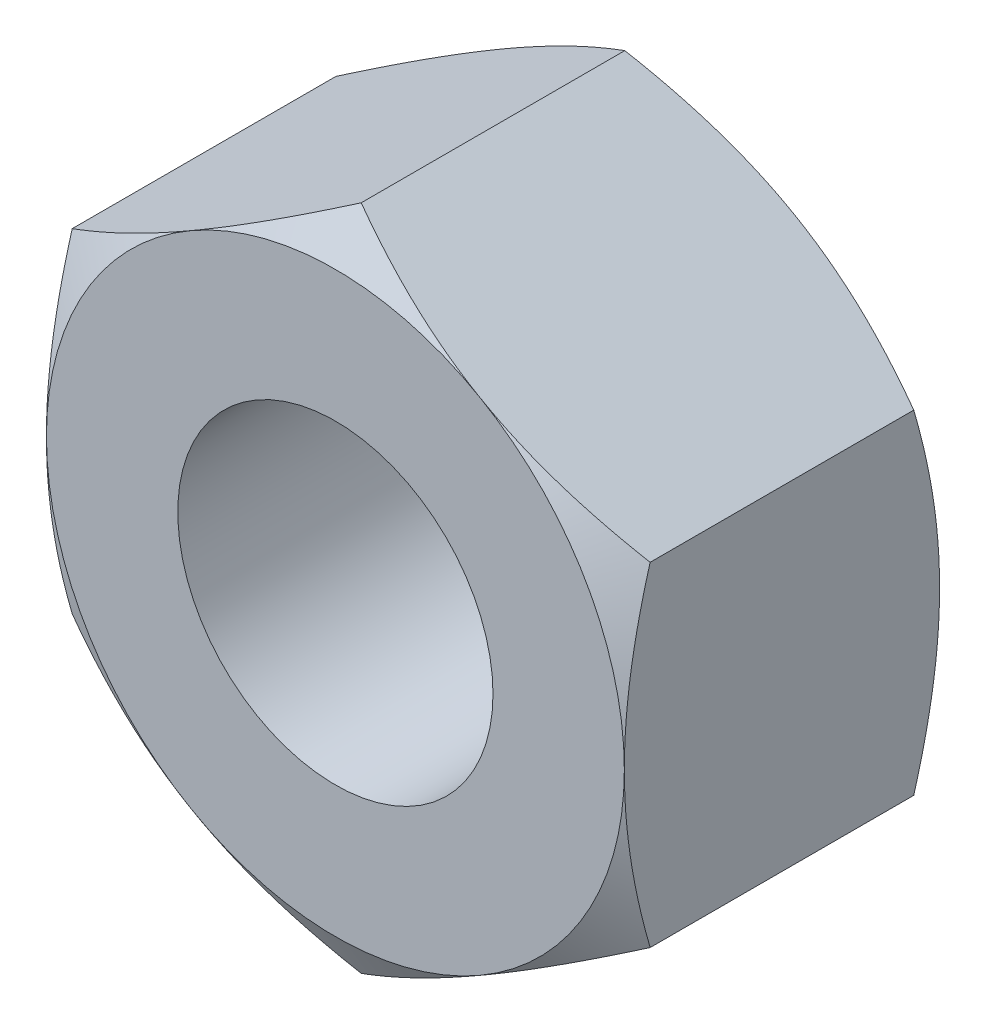
ISO-10303-21;
HEADER;
FILE_DESCRIPTION(('STEP AP214'),'2;1');
FILE_NAME('part.step','',(''),(''),'','','');
FILE_SCHEMA(('AUTOMOTIVE_DESIGN { 1 0 10303 214 1 1 1 1 }'));
ENDSEC;
DATA;
#1=APPLICATION_CONTEXT('core data for automotive mechanical design processes');
#2=APPLICATION_PROTOCOL_DEFINITION('international standard','automotive_design',2000,#1);
#3=PRODUCT_CONTEXT('',#1,'mechanical');
#4=PRODUCT('Part','Part','',(#3));
#5=PRODUCT_RELATED_PRODUCT_CATEGORY('part','',(#4));
#6=PRODUCT_DEFINITION_FORMATION('','',#4);
#7=PRODUCT_DEFINITION_CONTEXT('part definition',#1,'design');
#8=PRODUCT_DEFINITION('design','',#6,#7);
#9=PRODUCT_DEFINITION_SHAPE('','',#8);
#10=(LENGTH_UNIT() NAMED_UNIT(*) SI_UNIT(.MILLI.,.METRE.));
#11=(NAMED_UNIT(*) PLANE_ANGLE_UNIT() SI_UNIT($,.RADIAN.));
#12=(NAMED_UNIT(*) SI_UNIT($,.STERADIAN.) SOLID_ANGLE_UNIT());
#13=UNCERTAINTY_MEASURE_WITH_UNIT(LENGTH_MEASURE(1.E-05),#10,'distance_accuracy_value','');
#14=(GEOMETRIC_REPRESENTATION_CONTEXT(3) GLOBAL_UNCERTAINTY_ASSIGNED_CONTEXT((#13)) GLOBAL_UNIT_ASSIGNED_CONTEXT((#10,
#11,#12)) REPRESENTATION_CONTEXT('',''));
#15=CARTESIAN_POINT('',(0.,0.,0.));
#16=DIRECTION('',(0.,0.,1.));
#17=DIRECTION('',(1.,0.,0.));
#18=AXIS2_PLACEMENT_3D('',#15,#16,#17);
#19=CARTESIAN_POINT('',(0.,0.,3.));
#20=DIRECTION('',(0.,0.,1.));
#21=DIRECTION('',(1.,0.,0.));
#22=AXIS2_PLACEMENT_3D('',#19,#20,#21);
#23=PLANE('',#22);
#24=CARTESIAN_POINT('',(0.,0.,3.));
#25=DIRECTION('',(0.,0.,1.));
#26=DIRECTION('',(1.,0.,0.));
#27=AXIS2_PLACEMENT_3D('',#24,#25,#26);
#28=CIRCLE('',#27,2.75);
#29=CARTESIAN_POINT('',(2.74999999999998,0.,3.));
#30=VERTEX_POINT('',#29);
#31=CARTESIAN_POINT('',(1.375,-2.38156986040722,3.));
#32=VERTEX_POINT('',#31);
#33=EDGE_CURVE('E11',#30,#32,#28,.F.);
#34=ORIENTED_EDGE('',*,*,#33,.F.);
#35=CARTESIAN_POINT('',(1.37499999999998,2.38156986040719,3.));
#36=VERTEX_POINT('',#35);
#37=EDGE_CURVE('E38',#36,#30,#28,.F.);
#38=ORIENTED_EDGE('',*,*,#37,.F.);
#39=CARTESIAN_POINT('',(-1.375,2.38156986040719,3.));
#40=VERTEX_POINT('',#39);
#41=EDGE_CURVE('E277',#40,#36,#28,.F.);
#42=ORIENTED_EDGE('',*,*,#41,.F.);
#43=CARTESIAN_POINT('',(-2.75000000000001,0.,3.));
#44=VERTEX_POINT('',#43);
#45=EDGE_CURVE('E281',#44,#40,#28,.F.);
#46=ORIENTED_EDGE('',*,*,#45,.F.);
#47=CARTESIAN_POINT('',(-1.37500000000001,-2.38156986040722,3.));
#48=VERTEX_POINT('',#47);
#49=EDGE_CURVE('E305',#48,#44,#28,.F.);
#50=ORIENTED_EDGE('',*,*,#49,.F.);
#51=EDGE_CURVE('E43',#32,#48,#28,.F.);
#52=ORIENTED_EDGE('',*,*,#51,.F.);
#53=EDGE_LOOP('',(#34,#38,#42,#46,#50,#52));
#54=FACE_BOUND('',#53,.T.);
#55=CARTESIAN_POINT('',(0.,0.,3.));
#56=DIRECTION('',(0.,0.,1.));
#57=DIRECTION('',(1.,0.,0.));
#58=AXIS2_PLACEMENT_3D('',#55,#56,#57);
#59=CIRCLE('',#58,1.5);
#60=CARTESIAN_POINT('',(1.5,0.,3.));
#61=VERTEX_POINT('',#60);
#62=EDGE_CURVE('E248',#61,#61,#59,.T.);
#63=ORIENTED_EDGE('',*,*,#62,.F.);
#64=EDGE_LOOP('',(#63));
#65=FACE_BOUND('',#64,.T.);
#66=ADVANCED_FACE('F33',(#54,#65),#23,.T.);
#67=CARTESIAN_POINT('',(0.,0.,0.));
#68=DIRECTION('',(0.,0.,1.));
#69=DIRECTION('',(1.,0.,0.));
#70=AXIS2_PLACEMENT_3D('',#67,#68,#69);
#71=PLANE('',#70);
#72=CARTESIAN_POINT('',(0.,0.,0.));
#73=DIRECTION('',(0.,0.,1.));
#74=DIRECTION('',(1.,0.,0.));
#75=AXIS2_PLACEMENT_3D('',#72,#73,#74);
#76=CIRCLE('',#75,1.5);
#77=CARTESIAN_POINT('',(1.5,0.,0.));
#78=VERTEX_POINT('',#77);
#79=EDGE_CURVE('E251',#78,#78,#76,.F.);
#80=ORIENTED_EDGE('',*,*,#79,.F.);
#81=EDGE_LOOP('',(#80));
#82=FACE_BOUND('',#81,.T.);
#83=CARTESIAN_POINT('',(0.,0.,0.));
#84=DIRECTION('',(0.,0.,1.));
#85=DIRECTION('',(1.,0.,0.));
#86=AXIS2_PLACEMENT_3D('',#83,#84,#85);
#87=CIRCLE('',#86,2.75);
#88=CARTESIAN_POINT('',(1.37499999999998,2.38156986040719,0.));
#89=VERTEX_POINT('',#88);
#90=CARTESIAN_POINT('',(2.74999999999998,0.,0.));
#91=VERTEX_POINT('',#90);
#92=EDGE_CURVE('E142',#89,#91,#87,.F.);
#93=ORIENTED_EDGE('',*,*,#92,.T.);
#94=CARTESIAN_POINT('',(1.375,-2.38156986040722,0.));
#95=VERTEX_POINT('',#94);
#96=EDGE_CURVE('E150',#91,#95,#87,.F.);
#97=ORIENTED_EDGE('',*,*,#96,.T.);
#98=CARTESIAN_POINT('',(-1.37500000000001,-2.38156986040722,0.));
#99=VERTEX_POINT('',#98);
#100=EDGE_CURVE('E288',#95,#99,#87,.F.);
#101=ORIENTED_EDGE('',*,*,#100,.T.);
#102=CARTESIAN_POINT('',(-2.75000000000001,0.,0.));
#103=VERTEX_POINT('',#102);
#104=EDGE_CURVE('E291',#99,#103,#87,.F.);
#105=ORIENTED_EDGE('',*,*,#104,.T.);
#106=CARTESIAN_POINT('',(-1.375,2.38156986040719,0.));
#107=VERTEX_POINT('',#106);
#108=EDGE_CURVE('E154',#103,#107,#87,.F.);
#109=ORIENTED_EDGE('',*,*,#108,.T.);
#110=EDGE_CURVE('E128',#107,#89,#87,.F.);
#111=ORIENTED_EDGE('',*,*,#110,.T.);
#112=EDGE_LOOP('',(#93,#97,#101,#105,#109,#111));
#113=FACE_BOUND('',#112,.T.);
#114=ADVANCED_FACE('F151',(#82,#113),#71,.F.);
#115=CARTESIAN_POINT('',(0.,0.,-0.00100000000000013));
#116=DIRECTION('',(0.,0.,1.));
#117=DIRECTION('',(1.,0.,0.));
#118=AXIS2_PLACEMENT_3D('',#115,#116,#117);
#119=CYLINDRICAL_SURFACE('',#118,1.5);
#120=ORIENTED_EDGE('',*,*,#62,.T.);
#121=EDGE_LOOP('',(#120));
#122=FACE_BOUND('',#121,.T.);
#123=ORIENTED_EDGE('',*,*,#79,.T.);
#124=EDGE_LOOP('',(#123));
#125=FACE_BOUND('',#124,.T.);
#126=ADVANCED_FACE('F333',(#122,#125),#119,.F.);
#127=CARTESIAN_POINT('',(0.,0.,1.5));
#128=DIRECTION('',(0.,0.,1.));
#129=DIRECTION('',(1.,0.,0.));
#130=AXIS2_PLACEMENT_3D('',#127,#128,#129);
#131=CONICAL_SURFACE('',#130,5.34807621135335,1.0471975511966);
#132=CARTESIAN_POINT('',(2.74999999999999,-4.28121129604696,1.35004498448653));
#133=CARTESIAN_POINT('',(2.74999999999999,-4.16094515101063,1.2916392915186));
#134=CARTESIAN_POINT('',(2.74999999999999,-4.04040464859627,1.23378895099216));
#135=CARTESIAN_POINT('',(2.74999999999999,-3.79862905782631,1.11951104700759));
#136=CARTESIAN_POINT('',(2.74999999999999,-3.67739386504238,1.06308370473217));
#137=CARTESIAN_POINT('',(2.74999999999999,-3.43346643246003,0.951683586507976));
#138=CARTESIAN_POINT('',(2.74999999999999,-3.31076986375584,0.896720256911996));
#139=CARTESIAN_POINT('',(2.74999999999999,-3.06440637130703,0.789021573009839));
#140=CARTESIAN_POINT('',(2.74999999999999,-2.94073949329346,0.73628611444227));
#141=CARTESIAN_POINT('',(2.74999999999999,-2.68821925799042,0.631970508194709));
#142=CARTESIAN_POINT('',(2.74999999999999,-2.5593274885159,0.580482842892976));
#143=CARTESIAN_POINT('',(2.74999999999999,-2.30004216183129,0.481364697975267));
#144=CARTESIAN_POINT('',(2.74999999999999,-2.16964843888902,0.433734648774255));
#145=CARTESIAN_POINT('',(2.74999999999999,-1.90739040616219,0.343569812707522));
#146=CARTESIAN_POINT('',(2.74999999999999,-1.77552962618107,0.301024861162738));
#147=CARTESIAN_POINT('',(2.74999999999999,-1.50991676680324,0.222384420848071));
#148=CARTESIAN_POINT('',(2.74999999999999,-1.3761652919023,0.186286918863491));
#149=CARTESIAN_POINT('',(2.74999999999999,-1.10742266579271,0.122451181416053));
#150=CARTESIAN_POINT('',(2.74999999999999,-0.972442365810504,0.0946681000559768));
#151=CARTESIAN_POINT('',(2.74999999999999,-0.700786336816329,0.0490265017017877));
#152=CARTESIAN_POINT('',(2.74999999999999,-0.564110780126948,0.0311669842952757));
#153=CARTESIAN_POINT('',(2.74999999999999,-0.2915396982327,0.00703034298054747));
#154=CARTESIAN_POINT('',(2.74999999999999,-0.155657815579313,0.000602954817467059));
#155=CARTESIAN_POINT('',(2.74999999999998,0.116167194181799,-0.000521102835649774));
#156=CARTESIAN_POINT('',(2.74999999999998,0.252110322655291,0.0047825036839215));
#157=CARTESIAN_POINT('',(2.74999999999998,0.482384311425642,0.0233254688714906));
#158=CARTESIAN_POINT('',(2.74999999999998,0.576959770734784,0.0337056089646095));
#159=CARTESIAN_POINT('',(2.74999999999998,0.765425239593252,0.0595066443444489));
#160=CARTESIAN_POINT('',(2.74999999999998,0.859315156420784,0.0749282090457877));
#161=CARTESIAN_POINT('',(2.74999999999998,1.13982518882457,0.127945169335613));
#162=CARTESIAN_POINT('',(2.74999999999998,1.32518541509789,0.172283687079663));
#163=CARTESIAN_POINT('',(2.74999999999998,1.60243379706881,0.249269857226655));
#164=CARTESIAN_POINT('',(2.74999999999998,1.69575541306246,0.277049803580811));
#165=CARTESIAN_POINT('',(2.74999999999998,1.88149194744644,0.335517849898812));
#166=CARTESIAN_POINT('',(2.74999999999998,1.97390685927599,0.366205970888686));
#167=CARTESIAN_POINT('',(2.74999999999998,2.15785970684015,0.429995885164988));
#168=CARTESIAN_POINT('',(2.74999999999998,2.24939790831578,0.463096919070602));
#169=CARTESIAN_POINT('',(2.74999999999998,2.43171343920972,0.531320859958159));
#170=CARTESIAN_POINT('',(2.74999999999998,2.52249078257172,0.566443729794156));
#171=CARTESIAN_POINT('',(2.74999999999998,2.75598467411052,0.659297428837616));
#172=CARTESIAN_POINT('',(2.74999999999998,2.89819707336347,0.718294471081025));
#173=CARTESIAN_POINT('',(2.74999999999998,3.18125721223188,0.839486713828998));
#174=CARTESIAN_POINT('',(2.74999999999998,3.32210482865914,0.901682199894325));
#175=CARTESIAN_POINT('',(2.74999999999998,3.60272508078905,1.02855057419638));
#176=CARTESIAN_POINT('',(2.74999999999998,3.74249739692265,1.09322416715855));
#177=CARTESIAN_POINT('',(2.74999999999998,4.02113644239965,1.22449691364605));
#178=CARTESIAN_POINT('',(2.74999999999998,4.16000314744367,1.29109611858103));
#179=CARTESIAN_POINT('',(2.74999999999998,4.57587762893716,1.49333916222369));
#180=CARTESIAN_POINT('',(2.74999999999997,4.8517799018314,1.63125382887757));
#181=CARTESIAN_POINT('',(2.74999999999997,5.40153336587812,1.91096890530565));
#182=CARTESIAN_POINT('',(2.74999999999997,5.67538490048113,2.05276864501066));
#183=CARTESIAN_POINT('',(2.74999999999997,6.19498365828149,2.32507167218439));
#184=CARTESIAN_POINT('',(2.74999999999997,6.44086221213214,2.45532480094037));
#185=CARTESIAN_POINT('',(2.74999999999997,6.93177035377115,2.71744815998634));
#186=CARTESIAN_POINT('',(2.74999999999997,7.17679989807265,2.84931847158393));
#187=CARTESIAN_POINT('',(2.74999999999997,7.66547219099551,3.11387348550421));
#188=CARTESIAN_POINT('',(2.74999999999997,7.90911689578933,3.24655457885509));
#189=CARTESIAN_POINT('',(2.74999999999997,8.39587341964124,3.51285175521369));
#190=CARTESIAN_POINT('',(2.74999999999997,8.63898527393273,3.64646777379248));
#191=CARTESIAN_POINT('',(2.74999999999997,8.88190686818746,3.78042640070763));
#192=B_SPLINE_CURVE_WITH_KNOTS('',3,(#132,#133,#134,#135,#136,#137,#138,#139,#140,#141,#142,
#143,#144,#145,#146,#147,#148,#149,#150,#151,#152,#153,#154,#155,#156,#157,#158,#159,#160,#161,
#162,#163,#164,#165,#166,#167,#168,#169,#170,#171,#172,#173,#174,#175,#176,#177,#178,#179,#180,
#181,#182,#183,#184,#185,#186,#187,#188,#189,#190,#191),.UNSPECIFIED.,.F.,.F.,(4,2,2,2,2,2,2,2,
2,2,2,2,2,2,2,2,2,2,2,2,2,2,2,2,2,2,2,2,2,4),(0.,0.401098998012855,0.802259961018517,
1.20557674332304,1.6088746299843,2.02521206947431,2.44159589815847,2.85713297471785,
3.27254007221757,3.68566441941044,4.09874711123225,4.50635894860486,4.91398037646686,
5.19927254258241,5.48460260599595,6.05556312502472,6.34764385010842,6.63972668708953,
6.93171799470474,7.22370393945473,7.68554034304814,8.14741805175892,8.60942809881229,
9.0714504919412,9.99674918539686,10.921889282381,11.7566261442672,12.5914051479577,
13.4236907618507,14.255919574126),.UNSPECIFIED.);
#193=CARTESIAN_POINT('',(2.74999999999998,1.58771324027145,0.245620093061847));
#194=VERTEX_POINT('',#193);
#195=EDGE_CURVE('E145',#91,#194,#192,.T.);
#196=ORIENTED_EDGE('',*,*,#195,.F.);
#197=ORIENTED_EDGE('',*,*,#92,.F.);
#198=CARTESIAN_POINT('',(2.75019999999998,1.58759777021761,0.245686763364745));
#199=CARTESIAN_POINT('',(2.62935077934008,1.65737010029697,0.205387662249249));
#200=CARTESIAN_POINT('',(2.50745839737735,1.72774469983531,0.168736902597648));
#201=CARTESIAN_POINT('',(2.26156287327209,1.86971254687001,0.104762182969787));
#202=CARTESIAN_POINT('',(2.13755536142613,1.94130831721581,0.0774608556744841));
#203=CARTESIAN_POINT('',(1.89107720202404,2.08361254889597,0.0349617452941039));
#204=CARTESIAN_POINT('',(1.76864448141257,2.15429911309862,0.019481118622445));
#205=CARTESIAN_POINT('',(1.52320285763108,2.29600490065921,0.000999397369927517));
#206=CARTESIAN_POINT('',(1.40019484676708,2.36702360884401,-0.00201700053741349));
#207=CARTESIAN_POINT('',(1.1703412133892,2.49972966594895,0.00425314542853288));
#208=CARTESIAN_POINT('',(1.06346120874597,2.5614368654007,0.0120001542766883));
#209=CARTESIAN_POINT('',(0.850397532665243,2.68444923614044,0.0365551810643401));
#210=CARTESIAN_POINT('',(0.744214598351104,2.74575398185006,0.0533715896505554));
#211=CARTESIAN_POINT('',(0.53071151060681,2.86902004703204,0.0954119223459408));
#212=CARTESIAN_POINT('',(0.423418383857138,2.93096576264316,0.120814080687215));
#213=CARTESIAN_POINT('',(0.210432520715942,3.05393320806131,0.178467225839965));
#214=CARTESIAN_POINT('',(0.104737054973341,3.11495651365993,0.210704663298965));
#215=CARTESIAN_POINT('',(-0.000200000000006556,3.17554195059676,0.245686763364743));
#216=B_SPLINE_CURVE_WITH_KNOTS('',3,(#198,#199,#200,#201,#202,#203,#204,#205,#206,#207,#208,
#209,#210,#211,#212,#213,#214,#215),.UNSPECIFIED.,.F.,.F.,(4,2,2,2,2,2,2,2,4),(0.,
0.435912828725885,0.872873557116326,1.29901931904671,1.72464171213572,2.09526089052936,
2.46622354066373,2.84541551798556,3.22386274754523),.UNSPECIFIED.);
#217=EDGE_CURVE('E138',#194,#89,#216,.T.);
#218=ORIENTED_EDGE('',*,*,#217,.F.);
#219=EDGE_LOOP('',(#196,#197,#218));
#220=FACE_BOUND('',#219,.T.);
#221=ADVANCED_FACE('F143',(#220),#131,.T.);
#222=CARTESIAN_POINT('',(0.,3.17542648054292,0.245620093061845));
#223=VERTEX_POINT('',#222);
#224=EDGE_CURVE('E124',#89,#223,#216,.T.);
#225=ORIENTED_EDGE('',*,*,#224,.F.);
#226=ORIENTED_EDGE('',*,*,#110,.F.);
#227=CARTESIAN_POINT('',(0.000199999999993275,3.17554195059676,0.245686763364743));
#228=CARTESIAN_POINT('',(-0.120649220659912,3.10576962051741,0.205387662249247));
#229=CARTESIAN_POINT('',(-0.242541602622639,3.03539502097906,0.168736902597646));
#230=CARTESIAN_POINT('',(-0.488437126727896,2.89342717394437,0.104762182969786));
#231=CARTESIAN_POINT('',(-0.612444638573858,2.82183140359856,0.0774608556744834));
#232=CARTESIAN_POINT('',(-0.858922797975944,2.67952717191841,0.0349617452941039));
#233=CARTESIAN_POINT('',(-0.981355518587417,2.60884060771575,0.0194811186224454));
#234=CARTESIAN_POINT('',(-1.22679714236891,2.46713482015517,0.000999397369928483));
#235=CARTESIAN_POINT('',(-1.34980515323291,2.39611611197036,-0.00201700053741242));
#236=CARTESIAN_POINT('',(-1.57965878661079,2.26341005486543,0.00425314542853436));
#237=CARTESIAN_POINT('',(-1.68653879125402,2.20170285541367,0.0120001542766901));
#238=CARTESIAN_POINT('',(-1.89960246733475,2.07869048467393,0.0365551810643429));
#239=CARTESIAN_POINT('',(-2.00578540164889,2.01738573896432,0.0533715896505586));
#240=CARTESIAN_POINT('',(-2.21928848939319,1.89411967378233,0.0954119223459451));
#241=CARTESIAN_POINT('',(-2.32658161614286,1.83217395817121,0.12081408068722));
#242=CARTESIAN_POINT('',(-2.53956747928406,1.70920651275306,0.178467225839972));
#243=CARTESIAN_POINT('',(-2.64526294502666,1.64818320715444,0.210704663298972));
#244=CARTESIAN_POINT('',(-2.75020000000001,1.58759777021761,0.245686763364751));
#245=B_SPLINE_CURVE_WITH_KNOTS('',3,(#227,#228,#229,#230,#231,#232,#233,#234,#235,#236,#237,
#238,#239,#240,#241,#242,#243,#244),.UNSPECIFIED.,.F.,.F.,(4,2,2,2,2,2,2,2,4),(0.,
0.435912828725885,0.872873557116325,1.29901931904671,1.72464171213572,2.09526089052937,
2.46622354066374,2.84541551798557,3.22386274754525),.UNSPECIFIED.);
#246=EDGE_CURVE('E131',#223,#107,#245,.T.);
#247=ORIENTED_EDGE('',*,*,#246,.F.);
#248=EDGE_LOOP('',(#225,#226,#247));
#249=FACE_BOUND('',#248,.T.);
#250=ADVANCED_FACE('F126',(#249),#131,.T.);
#251=CARTESIAN_POINT('',(-2.75000000000001,1.58771324027145,0.245620093061853));
#252=VERTEX_POINT('',#251);
#253=EDGE_CURVE('E204',#107,#252,#245,.T.);
#254=ORIENTED_EDGE('',*,*,#253,.F.);
#255=ORIENTED_EDGE('',*,*,#108,.F.);
#256=CARTESIAN_POINT('',(-2.75,-4.28121129631959,1.35004498461896));
#257=CARTESIAN_POINT('',(-2.75,-4.16094515127409,1.29163929164549));
#258=CARTESIAN_POINT('',(-2.75,-4.04040464885056,1.23378895111352));
#259=CARTESIAN_POINT('',(-2.75,-3.79862905806222,1.1195110471179));
#260=CARTESIAN_POINT('',(-2.75,-3.67739386526909,1.06308370483697));
#261=CARTESIAN_POINT('',(-2.75,-3.43346643266818,0.95168358660176));
#262=CARTESIAN_POINT('',(-2.75,-3.31076986395465,0.896720257000268));
#263=CARTESIAN_POINT('',(-2.75,-3.06440637148708,0.789021573087179));
#264=CARTESIAN_POINT('',(-2.75,-2.94073949346409,0.736286114514191));
#265=CARTESIAN_POINT('',(-2.75,-2.68821925814153,0.631970508255652));
#266=CARTESIAN_POINT('',(-2.75,-2.55932748865689,0.580482842948372));
#267=CARTESIAN_POINT('',(-2.75,-2.30004216195188,0.481364698019869));
#268=CARTESIAN_POINT('',(-2.75000000000001,-2.16964843899934,0.433734648813609));
#269=CARTESIAN_POINT('',(-2.75000000000001,-1.90739040625175,0.343569812736889));
#270=CARTESIAN_POINT('',(-2.75000000000001,-1.77552962626016,0.301024861187363));
#271=CARTESIAN_POINT('',(-2.75000000000001,-1.5099167668611,0.222384420863995));
#272=CARTESIAN_POINT('',(-2.75000000000001,-1.37616529194939,0.186286918875455));
#273=CARTESIAN_POINT('',(-2.75000000000001,-1.1074226658127,0.122451181420036));
#274=CARTESIAN_POINT('',(-2.75000000000001,-0.972442365814082,0.0946681000562528));
#275=CARTESIAN_POINT('',(-2.75000000000001,-0.700786336786682,0.0490265016971372));
#276=CARTESIAN_POINT('',(-2.75000000000001,-0.564110780080493,0.031166984289404));
#277=CARTESIAN_POINT('',(-2.75000000000001,-0.291539698152913,0.00703034297522365));
#278=CARTESIAN_POINT('',(-2.75000000000001,-0.155657815483004,0.000602954813857859));
#279=CARTESIAN_POINT('',(-2.75000000000001,0.116167194310892,-0.000521102832964452));
#280=CARTESIAN_POINT('',(-2.75000000000001,0.252110322800646,0.00478250369118761));
#281=CARTESIAN_POINT('',(-2.75000000000001,0.48238431159152,0.0233254688879775));
#282=CARTESIAN_POINT('',(-2.75000000000001,0.576959770905106,0.0337056089847626));
#283=CARTESIAN_POINT('',(-2.75000000000001,0.765425239772267,0.0595066443721309));
#284=CARTESIAN_POINT('',(-2.75000000000001,0.859315156604048,0.0749282090773323));
#285=CARTESIAN_POINT('',(-2.75000000000001,1.13982518902036,0.127945169378829));
#286=CARTESIAN_POINT('',(-2.75000000000001,1.3251854153017,0.172283687130766));
#287=CARTESIAN_POINT('',(-2.75000000000001,1.60243379728463,0.249269857289403));
#288=CARTESIAN_POINT('',(-2.75000000000001,1.69575541328236,0.277049803647468));
#289=CARTESIAN_POINT('',(-2.75000000000001,1.88149194767446,0.335517849973171));
#290=CARTESIAN_POINT('',(-2.75000000000001,1.97390685950806,0.366205970966838));
#291=CARTESIAN_POINT('',(-2.75000000000001,2.15785970708028,0.429995885250594));
#292=CARTESIAN_POINT('',(-2.75000000000001,2.24939790855992,0.463096919159868));
#293=CARTESIAN_POINT('',(-2.75000000000001,2.43171343946188,0.531320860054623));
#294=CARTESIAN_POINT('',(-2.75000000000001,2.52249078282789,0.566443729894158));
#295=CARTESIAN_POINT('',(-2.75000000000001,2.75598467436917,0.659297428943464));
#296=CARTESIAN_POINT('',(-2.75000000000001,2.89819707362069,0.718294471188863));
#297=CARTESIAN_POINT('',(-2.75000000000001,3.18125721248641,0.839486713940276));
#298=CARTESIAN_POINT('',(-2.75000000000001,3.32210482891242,0.901682200007052));
#299=CARTESIAN_POINT('',(-2.75000000000001,3.60272508103995,1.02855057431161));
#300=CARTESIAN_POINT('',(-2.75000000000001,3.74249739717243,1.09322416727483));
#301=CARTESIAN_POINT('',(-2.75000000000001,4.0211364426473,1.22449691376413));
#302=CARTESIAN_POINT('',(-2.75000000000001,4.16000314769032,1.29109611869987));
#303=CARTESIAN_POINT('',(-2.75000000000001,4.57587762918082,1.49333916234444));
#304=CARTESIAN_POINT('',(-2.75000000000001,4.85177990207322,1.63125382899915));
#305=CARTESIAN_POINT('',(-2.75000000000001,5.4015333661165,1.9109689054284));
#306=CARTESIAN_POINT('',(-2.75000000000001,5.67538490071792,2.05276864513376));
#307=CARTESIAN_POINT('',(-2.75000000000001,6.19498365851666,2.32507167230853));
#308=CARTESIAN_POINT('',(-2.75000000000001,6.44086221236727,2.45532480106526));
#309=CARTESIAN_POINT('',(-2.75000000000002,6.93177035400626,2.71744816011255));
#310=CARTESIAN_POINT('',(-2.75000000000002,7.17679989830779,2.84931847171072));
#311=CARTESIAN_POINT('',(-2.75000000000002,7.66547219123096,3.11387348563219));
#312=CARTESIAN_POINT('',(-2.75000000000002,7.90911689602507,3.24655457898367));
#313=CARTESIAN_POINT('',(-2.75000000000002,8.39587341987759,3.51285175534339));
#314=CARTESIAN_POINT('',(-2.75000000000002,8.63898527416941,3.6464677739227));
#315=CARTESIAN_POINT('',(-2.75000000000002,8.88190686842449,3.78042640083836));
#316=B_SPLINE_CURVE_WITH_KNOTS('',3,(#256,#257,#258,#259,#260,#261,#262,#263,#264,#265,#266,
#267,#268,#269,#270,#271,#272,#273,#274,#275,#276,#277,#278,#279,#280,#281,#282,#283,#284,#285,
#286,#287,#288,#289,#290,#291,#292,#293,#294,#295,#296,#297,#298,#299,#300,#301,#302,#303,#304,
#305,#306,#307,#308,#309,#310,#311,#312,#313,#314,#315),.UNSPECIFIED.,.F.,.F.,(4,2,2,2,2,2,2,2,
2,2,2,2,2,2,2,2,2,2,2,2,2,2,2,2,2,2,2,2,2,4),(0.,0.401098998044856,0.802259961082524,
1.2055767434194,1.60887463011302,2.02521206963738,2.4415958983559,2.85713297494953,
3.27254007248347,3.68566441972672,4.09874711159882,4.50635894902052,4.91398037693163,
5.19927254306162,5.48460260648961,6.05556312554735,6.34764385064615,6.63972668764235,
6.93171799527262,7.22370394003768,7.68554034362941,8.14741805233852,8.60942809939016,
9.07145049251734,9.99674918596919,10.9218892829496,11.7566261448367,12.591405148528,
13.4236907624227,14.2559195746997),.UNSPECIFIED.);
#317=EDGE_CURVE('E197',#252,#103,#316,.F.);
#318=ORIENTED_EDGE('',*,*,#317,.F.);
#319=EDGE_LOOP('',(#254,#255,#318));
#320=FACE_BOUND('',#319,.T.);
#321=ADVANCED_FACE('F300',(#320),#131,.T.);
#322=CARTESIAN_POINT('',(-2.75000000000001,-1.58771324027181,0.245620093061646));
#323=VERTEX_POINT('',#322);
#324=EDGE_CURVE('E203',#103,#323,#316,.F.);
#325=ORIENTED_EDGE('',*,*,#324,.F.);
#326=ORIENTED_EDGE('',*,*,#104,.F.);
#327=CARTESIAN_POINT('',(-2.75020000000001,-1.58759777021765,0.24568676336476));
#328=CARTESIAN_POINT('',(-2.6293507793401,-1.657370100297,0.205387662249264));
#329=CARTESIAN_POINT('',(-2.50745839737737,-1.72774469983535,0.168736902597663));
#330=CARTESIAN_POINT('',(-2.26156287327211,-1.86971254687004,0.104762182969803));
#331=CARTESIAN_POINT('',(-2.13755536142615,-1.94130831721585,0.0774608556745002));
#332=CARTESIAN_POINT('',(-1.89107720202406,-2.08361254889601,0.0349617452941207));
#333=CARTESIAN_POINT('',(-1.76864448141259,-2.15429911309866,0.0194811186224622));
#334=CARTESIAN_POINT('',(-1.52320285763109,-2.29600490065924,0.000999397369945573));
#335=CARTESIAN_POINT('',(-1.40019484676709,-2.36702360884405,-0.00201700053739499));
#336=CARTESIAN_POINT('',(-1.17034121338921,-2.49972966594899,0.00425314542855226));
#337=CARTESIAN_POINT('',(-1.06346120874598,-2.56143686540074,0.012000154276708));
#338=CARTESIAN_POINT('',(-0.850397532665253,-2.68444923614048,0.0365551810643604));
#339=CARTESIAN_POINT('',(-0.744214598351114,-2.74575398185009,0.0533715896505758));
#340=CARTESIAN_POINT('',(-0.53071151060682,-2.86902004703208,0.0954119223459615));
#341=CARTESIAN_POINT('',(-0.423418383857149,-2.9309657626432,0.120814080687236));
#342=CARTESIAN_POINT('',(-0.210432520715953,-3.05393320806135,0.178467225839986));
#343=CARTESIAN_POINT('',(-0.104737054973352,-3.11495651365996,0.210704663298986));
#344=CARTESIAN_POINT('',(0.000199999999995274,-3.17554195059679,0.245686763364763));
#345=B_SPLINE_CURVE_WITH_KNOTS('',3,(#327,#328,#329,#330,#331,#332,#333,#334,#335,#336,#337,
#338,#339,#340,#341,#342,#343,#344),.UNSPECIFIED.,.F.,.F.,(4,2,2,2,2,2,2,2,4),(0.,
0.435912828725889,0.872873557116333,1.29901931904672,1.72464171213574,2.09526089052938,
2.46622354066374,2.84541551798557,3.22386274754524),.UNSPECIFIED.);
#346=EDGE_CURVE('E205',#323,#99,#345,.T.);
#347=ORIENTED_EDGE('',*,*,#346,.F.);
#348=EDGE_LOOP('',(#325,#326,#347));
#349=FACE_BOUND('',#348,.T.);
#350=ADVANCED_FACE('F182',(#349),#131,.T.);
#351=CARTESIAN_POINT('',(0.,-3.17542648054295,0.245620093061865));
#352=VERTEX_POINT('',#351);
#353=EDGE_CURVE('E353',#99,#352,#345,.T.);
#354=ORIENTED_EDGE('',*,*,#353,.F.);
#355=ORIENTED_EDGE('',*,*,#100,.F.);
#356=CARTESIAN_POINT('',(-0.000200000000004715,-3.17554195059679,0.245686763364763));
#357=CARTESIAN_POINT('',(0.120649220659902,-3.10576962051744,0.205387662249267));
#358=CARTESIAN_POINT('',(0.24254160262263,-3.03539502097909,0.168736902597666));
#359=CARTESIAN_POINT('',(0.48843712672789,-2.8934271739444,0.104762182969805));
#360=CARTESIAN_POINT('',(0.612444638573853,-2.8218314035986,0.0774608556745023));
#361=CARTESIAN_POINT('',(0.858922797975943,-2.67952717191844,0.0349617452941224));
#362=CARTESIAN_POINT('',(0.981355518587416,-2.60884060771578,0.0194811186224638));
#363=CARTESIAN_POINT('',(1.22679714236892,-2.4671348201552,0.000999397369946781));
#364=CARTESIAN_POINT('',(1.34980515323291,-2.39611611197039,-0.00201700053739398));
#365=CARTESIAN_POINT('',(1.57965878661079,-2.26341005486546,0.00425314542855296));
#366=CARTESIAN_POINT('',(1.68653879125402,-2.2017028554137,0.0120001542767084));
#367=CARTESIAN_POINT('',(1.89960246733475,-2.07869048467396,0.0365551810643602));
#368=CARTESIAN_POINT('',(2.00578540164888,-2.01738573896435,0.0533715896505752));
#369=CARTESIAN_POINT('',(2.21928848939318,-1.89411967378237,0.09541192234596));
#370=CARTESIAN_POINT('',(2.32658161614285,-1.83217395817125,0.120814080687234));
#371=CARTESIAN_POINT('',(2.53956747928404,-1.7092065127531,0.178467225839983));
#372=CARTESIAN_POINT('',(2.64526294502664,-1.64818320715448,0.210704663298982));
#373=CARTESIAN_POINT('',(2.75019999999999,-1.58759777021765,0.245686763364759));
#374=B_SPLINE_CURVE_WITH_KNOTS('',3,(#356,#357,#358,#359,#360,#361,#362,#363,#364,#365,#366,
#367,#368,#369,#370,#371,#372,#373),.UNSPECIFIED.,.F.,.F.,(4,2,2,2,2,2,2,2,4),(0.,
0.43591282872589,0.872873557116335,1.29901931904672,1.72464171213574,2.09526089052938,
2.46622354066374,2.84541551798556,3.22386274754523),.UNSPECIFIED.);
#375=EDGE_CURVE('E163',#352,#95,#374,.T.);
#376=ORIENTED_EDGE('',*,*,#375,.F.);
#377=EDGE_LOOP('',(#354,#355,#376));
#378=FACE_BOUND('',#377,.T.);
#379=ADVANCED_FACE('F177',(#378),#131,.T.);
#380=CARTESIAN_POINT('',(2.74999999999999,-1.58771324027149,0.245620093061861));
#381=VERTEX_POINT('',#380);
#382=EDGE_CURVE('E159',#95,#381,#374,.T.);
#383=ORIENTED_EDGE('',*,*,#382,.F.);
#384=ORIENTED_EDGE('',*,*,#96,.F.);
#385=EDGE_CURVE('E136',#381,#91,#192,.T.);
#386=ORIENTED_EDGE('',*,*,#385,.F.);
#387=EDGE_LOOP('',(#383,#384,#386));
#388=FACE_BOUND('',#387,.T.);
#389=ADVANCED_FACE('F181',(#388),#131,.T.);
#390=CARTESIAN_POINT('',(0.,0.,4.));
#391=DIRECTION('',(0.,0.,-1.));
#392=DIRECTION('',(-1.,0.,0.));
#393=AXIS2_PLACEMENT_3D('',#390,#391,#392);
#394=CONICAL_SURFACE('',#393,1.0179491924311,1.0471975511966);
#395=CARTESIAN_POINT('',(-0.000200000000006725,3.17554195059676,2.75431323663526));
#396=CARTESIAN_POINT('',(0.120649220659898,3.10576962051741,2.79461233775075));
#397=CARTESIAN_POINT('',(0.242541602622625,3.03539502097906,2.83126309740235));
#398=CARTESIAN_POINT('',(0.488437126727882,2.89342717394437,2.89523781703021));
#399=CARTESIAN_POINT('',(0.612444638573844,2.82183140359856,2.92253914432552));
#400=CARTESIAN_POINT('',(0.85892279797593,2.67952717191841,2.9650382547059));
#401=CARTESIAN_POINT('',(0.981355518587402,2.60884060771575,2.98051888137756));
#402=CARTESIAN_POINT('',(1.2267971423689,2.46713482015517,2.99900060263007));
#403=CARTESIAN_POINT('',(1.34980515323289,2.39611611197036,3.00201700053741));
#404=CARTESIAN_POINT('',(1.57965878661077,2.26341005486543,2.99574685457147));
#405=CARTESIAN_POINT('',(1.686538791254,2.20170285541367,2.98799984572331));
#406=CARTESIAN_POINT('',(1.89960246733473,2.07869048467393,2.96344481893566));
#407=CARTESIAN_POINT('',(2.00578540164887,2.01738573896432,2.94662841034944));
#408=CARTESIAN_POINT('',(2.21928848939317,1.89411967378233,2.90458807765406));
#409=CARTESIAN_POINT('',(2.32658161614284,1.83217395817121,2.87918591931278));
#410=CARTESIAN_POINT('',(2.53956747928403,1.70920651275306,2.82153277416003));
#411=CARTESIAN_POINT('',(2.64526294502663,1.64818320715444,2.78929533670103));
#412=CARTESIAN_POINT('',(2.75019999999998,1.58759777021762,2.75431323663526));
#413=B_SPLINE_CURVE_WITH_KNOTS('',3,(#395,#396,#397,#398,#399,#400,#401,#402,#403,#404,#405,
#406,#407,#408,#409,#410,#411,#412),.UNSPECIFIED.,.F.,.F.,(4,2,2,2,2,2,2,2,4),(0.,
0.435912828725884,0.872873557116325,1.2990193190467,1.72464171213572,2.09526089052936,
2.46622354066373,2.84541551798556,3.22386274754523),.UNSPECIFIED.);
#414=CARTESIAN_POINT('',(2.74999999999998,1.58771324027145,2.75437990693815));
#415=VERTEX_POINT('',#414);
#416=EDGE_CURVE('E247',#36,#415,#413,.T.);
#417=ORIENTED_EDGE('',*,*,#416,.F.);
#418=ORIENTED_EDGE('',*,*,#37,.T.);
#419=CARTESIAN_POINT('',(2.74999999999999,-4.28121129604696,1.64995501551347));
#420=CARTESIAN_POINT('',(2.74999999999999,-4.16094515101063,1.70836070848141));
#421=CARTESIAN_POINT('',(2.74999999999999,-4.04040464859627,1.76621104900784));
#422=CARTESIAN_POINT('',(2.74999999999999,-3.79862905782631,1.88048895299241));
#423=CARTESIAN_POINT('',(2.74999999999999,-3.67739386504239,1.93691629526783));
#424=CARTESIAN_POINT('',(2.74999999999999,-3.43346643246003,2.04831641349202));
#425=CARTESIAN_POINT('',(2.74999999999999,-3.31076986375585,2.103279743088));
#426=CARTESIAN_POINT('',(2.74999999999999,-3.06440637130703,2.21097842699016));
#427=CARTESIAN_POINT('',(2.74999999999999,-2.94073949329346,2.26371388555773));
#428=CARTESIAN_POINT('',(2.74999999999999,-2.68821925799042,2.36802949180529));
#429=CARTESIAN_POINT('',(2.74999999999999,-2.5593274885159,2.41951715710702));
#430=CARTESIAN_POINT('',(2.74999999999999,-2.30004216183129,2.51863530202473));
#431=CARTESIAN_POINT('',(2.74999999999999,-2.16964843888902,2.56626535122575));
#432=CARTESIAN_POINT('',(2.74999999999999,-1.90739040616219,2.65643018729248));
#433=CARTESIAN_POINT('',(2.74999999999999,-1.77552962618107,2.69897513883726));
#434=CARTESIAN_POINT('',(2.74999999999999,-1.50991676680324,2.77761557915193));
#435=CARTESIAN_POINT('',(2.74999999999999,-1.3761652919023,2.81371308113651));
#436=CARTESIAN_POINT('',(2.74999999999999,-1.10742266579271,2.87754881858395));
#437=CARTESIAN_POINT('',(2.74999999999999,-0.972442365810504,2.90533189994402));
#438=CARTESIAN_POINT('',(2.74999999999999,-0.700786336816329,2.95097349829821));
#439=CARTESIAN_POINT('',(2.74999999999999,-0.564110780126948,2.96883301570472));
#440=CARTESIAN_POINT('',(2.74999999999999,-0.2915396982327,2.99296965701945));
#441=CARTESIAN_POINT('',(2.74999999999999,-0.155657815579313,2.99939704518253));
#442=CARTESIAN_POINT('',(2.74999999999998,0.116167194181799,3.00052110283565));
#443=CARTESIAN_POINT('',(2.74999999999998,0.252110322655291,2.99521749631608));
#444=CARTESIAN_POINT('',(2.74999999999998,0.482384311425642,2.97667453112851));
#445=CARTESIAN_POINT('',(2.74999999999998,0.576959770734784,2.96629439103539));
#446=CARTESIAN_POINT('',(2.74999999999998,0.765425239593251,2.94049335565555));
#447=CARTESIAN_POINT('',(2.74999999999998,0.859315156420783,2.92507179095421));
#448=CARTESIAN_POINT('',(2.74999999999998,1.13982518882457,2.87205483066439));
#449=CARTESIAN_POINT('',(2.74999999999998,1.32518541509789,2.82771631292034));
#450=CARTESIAN_POINT('',(2.74999999999998,1.60243379706881,2.75073014277335));
#451=CARTESIAN_POINT('',(2.74999999999998,1.69575541306246,2.72295019641919));
#452=CARTESIAN_POINT('',(2.74999999999998,1.88149194744644,2.66448215010119));
#453=CARTESIAN_POINT('',(2.74999999999998,1.97390685927599,2.63379402911131));
#454=CARTESIAN_POINT('',(2.74999999999998,2.15785970684015,2.57000411483501));
#455=CARTESIAN_POINT('',(2.74999999999998,2.24939790831578,2.5369030809294));
#456=CARTESIAN_POINT('',(2.74999999999998,2.43171343920972,2.46867914004184));
#457=CARTESIAN_POINT('',(2.74999999999998,2.52249078257172,2.43355627020584));
#458=CARTESIAN_POINT('',(2.74999999999998,2.75598467411052,2.34070257116238));
#459=CARTESIAN_POINT('',(2.74999999999998,2.89819707336347,2.28170552891898));
#460=CARTESIAN_POINT('',(2.74999999999998,3.18125721223188,2.160513286171));
#461=CARTESIAN_POINT('',(2.74999999999998,3.32210482865914,2.09831780010567));
#462=CARTESIAN_POINT('',(2.74999999999998,3.60272508078905,1.97144942580362));
#463=CARTESIAN_POINT('',(2.74999999999998,3.74249739692266,1.90677583284145));
#464=CARTESIAN_POINT('',(2.74999999999998,4.02113644239966,1.77550308635395));
#465=CARTESIAN_POINT('',(2.74999999999998,4.16000314744368,1.70890388141897));
#466=CARTESIAN_POINT('',(2.74999999999998,4.57587762893716,1.50666083777631));
#467=CARTESIAN_POINT('',(2.74999999999997,4.85177990183141,1.36874617112243));
#468=CARTESIAN_POINT('',(2.74999999999997,5.40153336587812,1.08903109469435));
#469=CARTESIAN_POINT('',(2.74999999999997,5.67538490048113,0.947231354989342));
#470=CARTESIAN_POINT('',(2.74999999999997,6.19498365828149,0.674928327815612));
#471=CARTESIAN_POINT('',(2.74999999999997,6.44086221213214,0.544675199059628));
#472=CARTESIAN_POINT('',(2.74999999999997,6.93177035377115,0.282551840013662));
#473=CARTESIAN_POINT('',(2.74999999999997,7.17679989807265,0.150681528416071));
#474=CARTESIAN_POINT('',(2.74999999999997,7.66547219099551,-0.113873485504208));
#475=CARTESIAN_POINT('',(2.74999999999997,7.90911689578933,-0.246554578855091));
#476=CARTESIAN_POINT('',(2.74999999999997,8.39587341964123,-0.512851755213692));
#477=CARTESIAN_POINT('',(2.74999999999997,8.63898527393273,-0.646467773792476));
#478=CARTESIAN_POINT('',(2.74999999999997,8.88190686818746,-0.780426400707631));
#479=B_SPLINE_CURVE_WITH_KNOTS('',3,(#419,#420,#421,#422,#423,#424,#425,#426,#427,#428,#429,
#430,#431,#432,#433,#434,#435,#436,#437,#438,#439,#440,#441,#442,#443,#444,#445,#446,#447,#448,
#449,#450,#451,#452,#453,#454,#455,#456,#457,#458,#459,#460,#461,#462,#463,#464,#465,#466,#467,
#468,#469,#470,#471,#472,#473,#474,#475,#476,#477,#478),.UNSPECIFIED.,.F.,.F.,(4,2,2,2,2,2,2,2,
2,2,2,2,2,2,2,2,2,2,2,2,2,2,2,2,2,2,2,2,2,4),(0.,0.401098998012854,0.802259961018517,
1.20557674332304,1.60887462998431,2.02521206947431,2.44159589815847,2.85713297471785,
3.27254007221757,3.68566441941044,4.09874711123225,4.50635894860486,4.91398037646686,
5.1992725425824,5.48460260599594,6.05556312502472,6.34764385010842,6.63972668708952,
6.93171799470474,7.22370393945473,7.68554034304813,8.14741805175892,8.60942809881229,
9.0714504919412,9.99674918539686,10.921889282381,11.7566261442672,12.5914051479577,
13.4236907618506,14.255919574126),.UNSPECIFIED.);
#480=EDGE_CURVE('E252',#415,#30,#479,.F.);
#481=ORIENTED_EDGE('',*,*,#480,.F.);
#482=EDGE_LOOP('',(#417,#418,#481));
#483=FACE_BOUND('',#482,.T.);
#484=ADVANCED_FACE('F184',(#483),#394,.T.);
#485=CARTESIAN_POINT('',(-2.75020000000001,1.58759777021761,2.75431323663525));
#486=CARTESIAN_POINT('',(-2.6293507793401,1.65737010029696,2.79461233775075));
#487=CARTESIAN_POINT('',(-2.50745839737738,1.72774469983531,2.83126309740235));
#488=CARTESIAN_POINT('',(-2.26156287327212,1.86971254687,2.89523781703021));
#489=CARTESIAN_POINT('',(-2.13755536142616,1.94130831721581,2.92253914432551));
#490=CARTESIAN_POINT('',(-1.89107720202407,2.08361254889596,2.96503825470589));
#491=CARTESIAN_POINT('',(-1.7686444814126,2.15429911309862,2.98051888137755));
#492=CARTESIAN_POINT('',(-1.5232028576311,2.2960049006592,2.99900060263007));
#493=CARTESIAN_POINT('',(-1.4001948467671,2.36702360884401,3.00201700053741));
#494=CARTESIAN_POINT('',(-1.17034121338922,2.49972966594894,2.99574685457147));
#495=CARTESIAN_POINT('',(-1.06346120874599,2.5614368654007,2.98799984572331));
#496=CARTESIAN_POINT('',(-0.850397532665263,2.68444923614044,2.96344481893566));
#497=CARTESIAN_POINT('',(-0.744214598351123,2.74575398185005,2.94662841034944));
#498=CARTESIAN_POINT('',(-0.530711510606827,2.86902004703204,2.90458807765406));
#499=CARTESIAN_POINT('',(-0.423418383857155,2.93096576264316,2.87918591931279));
#500=CARTESIAN_POINT('',(-0.210432520715957,3.05393320806131,2.82153277416004));
#501=CARTESIAN_POINT('',(-0.104737054973355,3.11495651365993,2.78929533670103));
#502=CARTESIAN_POINT('',(0.000199999999993218,3.17554195059676,2.75431323663526));
#503=B_SPLINE_CURVE_WITH_KNOTS('',3,(#485,#486,#487,#488,#489,#490,#491,#492,#493,#494,#495,
#496,#497,#498,#499,#500,#501,#502),.UNSPECIFIED.,.F.,.F.,(4,2,2,2,2,2,2,2,4),(0.,
0.435912828725886,0.872873557116328,1.29901931904671,1.72464171213573,2.09526089052937,
2.46622354066374,2.84541551798557,3.22386274754524),.UNSPECIFIED.);
#504=CARTESIAN_POINT('',(0.,3.17542648054292,2.75437990693816));
#505=VERTEX_POINT('',#504);
#506=EDGE_CURVE('E240',#40,#505,#503,.T.);
#507=ORIENTED_EDGE('',*,*,#506,.F.);
#508=ORIENTED_EDGE('',*,*,#41,.T.);
#509=EDGE_CURVE('E241',#505,#36,#413,.T.);
#510=ORIENTED_EDGE('',*,*,#509,.F.);
#511=EDGE_LOOP('',(#507,#508,#510));
#512=FACE_BOUND('',#511,.T.);
#513=ADVANCED_FACE('F274',(#512),#394,.T.);
#514=CARTESIAN_POINT('',(-2.75,-4.28121129631959,1.64995501538104));
#515=CARTESIAN_POINT('',(-2.75,-4.16094515127409,1.70836070835451));
#516=CARTESIAN_POINT('',(-2.75,-4.04040464885056,1.76621104888648));
#517=CARTESIAN_POINT('',(-2.75,-3.79862905806222,1.8804889528821));
#518=CARTESIAN_POINT('',(-2.75,-3.67739386526909,1.93691629516303));
#519=CARTESIAN_POINT('',(-2.75,-3.43346643266818,2.04831641339824));
#520=CARTESIAN_POINT('',(-2.75,-3.31076986395465,2.10327974299973));
#521=CARTESIAN_POINT('',(-2.75,-3.06440637148708,2.21097842691282));
#522=CARTESIAN_POINT('',(-2.75,-2.9407394934641,2.26371388548581));
#523=CARTESIAN_POINT('',(-2.75,-2.68821925814153,2.36802949174435));
#524=CARTESIAN_POINT('',(-2.75,-2.55932748865689,2.41951715705163));
#525=CARTESIAN_POINT('',(-2.75,-2.30004216195188,2.51863530198013));
#526=CARTESIAN_POINT('',(-2.75000000000001,-2.16964843899934,2.56626535118639));
#527=CARTESIAN_POINT('',(-2.75000000000001,-1.90739040625175,2.65643018726311));
#528=CARTESIAN_POINT('',(-2.75000000000001,-1.77552962626016,2.69897513881264));
#529=CARTESIAN_POINT('',(-2.75000000000001,-1.5099167668611,2.777615579136));
#530=CARTESIAN_POINT('',(-2.75000000000001,-1.37616529194939,2.81371308112455));
#531=CARTESIAN_POINT('',(-2.75000000000001,-1.1074226658127,2.87754881857996));
#532=CARTESIAN_POINT('',(-2.75000000000001,-0.972442365814082,2.90533189994375));
#533=CARTESIAN_POINT('',(-2.75000000000001,-0.700786336786682,2.95097349830286));
#534=CARTESIAN_POINT('',(-2.75000000000001,-0.564110780080493,2.9688330157106));
#535=CARTESIAN_POINT('',(-2.75000000000001,-0.291539698152913,2.99296965702478));
#536=CARTESIAN_POINT('',(-2.75000000000001,-0.155657815483004,2.99939704518614));
#537=CARTESIAN_POINT('',(-2.75000000000001,0.116167194310892,3.00052110283296));
#538=CARTESIAN_POINT('',(-2.75000000000001,0.252110322800646,2.99521749630881));
#539=CARTESIAN_POINT('',(-2.75000000000001,0.48238431159152,2.97667453111202));
#540=CARTESIAN_POINT('',(-2.75000000000001,0.576959770905106,2.96629439101524));
#541=CARTESIAN_POINT('',(-2.75000000000001,0.765425239772267,2.94049335562787));
#542=CARTESIAN_POINT('',(-2.75000000000001,0.859315156604048,2.92507179092267));
#543=CARTESIAN_POINT('',(-2.75000000000001,1.13982518902036,2.87205483062117));
#544=CARTESIAN_POINT('',(-2.75000000000001,1.3251854153017,2.82771631286923));
#545=CARTESIAN_POINT('',(-2.75000000000001,1.60243379728463,2.7507301427106));
#546=CARTESIAN_POINT('',(-2.75000000000001,1.69575541328236,2.72295019635253));
#547=CARTESIAN_POINT('',(-2.75000000000001,1.88149194767447,2.66448215002683));
#548=CARTESIAN_POINT('',(-2.75000000000001,1.97390685950806,2.63379402903316));
#549=CARTESIAN_POINT('',(-2.75000000000001,2.15785970708028,2.57000411474941));
#550=CARTESIAN_POINT('',(-2.75000000000001,2.24939790855992,2.53690308084013));
#551=CARTESIAN_POINT('',(-2.75000000000001,2.43171343946188,2.46867913994538));
#552=CARTESIAN_POINT('',(-2.75000000000001,2.52249078282789,2.43355627010584));
#553=CARTESIAN_POINT('',(-2.75000000000001,2.75598467436917,2.34070257105654));
#554=CARTESIAN_POINT('',(-2.75000000000001,2.89819707362069,2.28170552881114));
#555=CARTESIAN_POINT('',(-2.75000000000001,3.18125721248641,2.16051328605972));
#556=CARTESIAN_POINT('',(-2.75000000000001,3.32210482891242,2.09831779999295));
#557=CARTESIAN_POINT('',(-2.75000000000001,3.60272508103995,1.97144942568839));
#558=CARTESIAN_POINT('',(-2.75000000000001,3.74249739717243,1.90677583272517));
#559=CARTESIAN_POINT('',(-2.75000000000001,4.0211364426473,1.77550308623587));
#560=CARTESIAN_POINT('',(-2.75000000000001,4.16000314769032,1.70890388130013));
#561=CARTESIAN_POINT('',(-2.75000000000001,4.57587762918082,1.50666083765556));
#562=CARTESIAN_POINT('',(-2.75000000000001,4.85177990207322,1.36874617100085));
#563=CARTESIAN_POINT('',(-2.75000000000001,5.4015333661165,1.0890310945716));
#564=CARTESIAN_POINT('',(-2.75000000000001,5.67538490071792,0.947231354866244));
#565=CARTESIAN_POINT('',(-2.75000000000001,6.19498365851666,0.674928327691467));
#566=CARTESIAN_POINT('',(-2.75000000000001,6.44086221236727,0.544675198934745));
#567=CARTESIAN_POINT('',(-2.75000000000002,6.93177035400625,0.282551839887453));
#568=CARTESIAN_POINT('',(-2.75000000000002,7.17679989830779,0.150681528289275));
#569=CARTESIAN_POINT('',(-2.75000000000002,7.66547219123096,-0.113873485632187));
#570=CARTESIAN_POINT('',(-2.75000000000002,7.90911689602507,-0.246554578983668));
#571=CARTESIAN_POINT('',(-2.75000000000002,8.39587341987759,-0.512851755343394));
#572=CARTESIAN_POINT('',(-2.75000000000002,8.63898527416941,-0.646467773922705));
#573=CARTESIAN_POINT('',(-2.75000000000002,8.88190686842449,-0.780426400838364));
#574=B_SPLINE_CURVE_WITH_KNOTS('',3,(#514,#515,#516,#517,#518,#519,#520,#521,#522,#523,#524,
#525,#526,#527,#528,#529,#530,#531,#532,#533,#534,#535,#536,#537,#538,#539,#540,#541,#542,#543,
#544,#545,#546,#547,#548,#549,#550,#551,#552,#553,#554,#555,#556,#557,#558,#559,#560,#561,#562,
#563,#564,#565,#566,#567,#568,#569,#570,#571,#572,#573),.UNSPECIFIED.,.F.,.F.,(4,2,2,2,2,2,2,2,
2,2,2,2,2,2,2,2,2,2,2,2,2,2,2,2,2,2,2,2,2,4),(0.,0.401098998044854,0.802259961082523,
1.2055767434194,1.60887463011302,2.02521206963738,2.4415958983559,2.85713297494953,
3.27254007248347,3.68566441972672,4.09874711159882,4.50635894902052,4.91398037693163,
5.19927254306162,5.48460260648961,6.05556312554735,6.34764385064615,6.63972668764235,
6.93171799527262,7.22370394003768,7.68554034362941,8.14741805233852,8.60942809939016,
9.07145049251734,9.99674918596918,10.9218892829496,11.7566261448367,12.591405148528,
13.4236907624227,14.2559195746997),.UNSPECIFIED.);
#575=CARTESIAN_POINT('',(-2.75000000000001,1.58771324027145,2.75437990693815));
#576=VERTEX_POINT('',#575);
#577=EDGE_CURVE('E228',#44,#576,#574,.T.);
#578=ORIENTED_EDGE('',*,*,#577,.F.);
#579=ORIENTED_EDGE('',*,*,#45,.T.);
#580=EDGE_CURVE('E234',#576,#40,#503,.T.);
#581=ORIENTED_EDGE('',*,*,#580,.F.);
#582=EDGE_LOOP('',(#578,#579,#581));
#583=FACE_BOUND('',#582,.T.);
#584=ADVANCED_FACE('F302',(#583),#394,.T.);
#585=CARTESIAN_POINT('',(0.000199999999995295,-3.17554195059679,2.75431323663524));
#586=CARTESIAN_POINT('',(-0.120649220659911,-3.10576962051744,2.79461233775073));
#587=CARTESIAN_POINT('',(-0.24254160262264,-3.03539502097909,2.83126309740233));
#588=CARTESIAN_POINT('',(-0.4884371267279,-2.8934271739444,2.8952378170302));
#589=CARTESIAN_POINT('',(-0.612444638573863,-2.8218314035986,2.9225391443255));
#590=CARTESIAN_POINT('',(-0.858922797975952,-2.67952717191844,2.96503825470588));
#591=CARTESIAN_POINT('',(-0.981355518587426,-2.60884060771578,2.98051888137754));
#592=CARTESIAN_POINT('',(-1.22679714236893,-2.4671348201552,2.99900060263005));
#593=CARTESIAN_POINT('',(-1.34980515323292,-2.39611611197039,3.0020170005374));
#594=CARTESIAN_POINT('',(-1.5796587866108,-2.26341005486545,2.99574685457145));
#595=CARTESIAN_POINT('',(-1.68653879125403,-2.2017028554137,2.98799984572329));
#596=CARTESIAN_POINT('',(-1.89960246733476,-2.07869048467396,2.96344481893564));
#597=CARTESIAN_POINT('',(-2.0057854016489,-2.01738573896435,2.94662841034943));
#598=CARTESIAN_POINT('',(-2.21928848939319,-1.89411967378236,2.90458807765404));
#599=CARTESIAN_POINT('',(-2.32658161614286,-1.83217395817124,2.87918591931277));
#600=CARTESIAN_POINT('',(-2.53956747928406,-1.70920651275309,2.82153277416002));
#601=CARTESIAN_POINT('',(-2.64526294502666,-1.64818320715448,2.78929533670102));
#602=CARTESIAN_POINT('',(-2.75020000000001,-1.58759777021765,2.75431323663524));
#603=B_SPLINE_CURVE_WITH_KNOTS('',3,(#585,#586,#587,#588,#589,#590,#591,#592,#593,#594,#595,
#596,#597,#598,#599,#600,#601,#602),.UNSPECIFIED.,.F.,.F.,(4,2,2,2,2,2,2,2,4),(0.,
0.435912828725889,0.872873557116334,1.29901931904672,1.72464171213574,2.09526089052938,
2.46622354066375,2.84541551798557,3.22386274754524),.UNSPECIFIED.);
#604=CARTESIAN_POINT('',(-2.75000000000001,-1.58771324027149,2.75437990693814));
#605=VERTEX_POINT('',#604);
#606=EDGE_CURVE('E57',#48,#605,#603,.T.);
#607=ORIENTED_EDGE('',*,*,#606,.F.);
#608=ORIENTED_EDGE('',*,*,#49,.T.);
#609=EDGE_CURVE('E221',#605,#44,#574,.T.);
#610=ORIENTED_EDGE('',*,*,#609,.F.);
#611=EDGE_LOOP('',(#607,#608,#610));
#612=FACE_BOUND('',#611,.T.);
#613=ADVANCED_FACE('F303',(#612),#394,.T.);
#614=CARTESIAN_POINT('',(2.75019999999999,-1.58759777021765,2.75431323663524));
#615=CARTESIAN_POINT('',(2.62935077934008,-1.65737010029701,2.79461233775074));
#616=CARTESIAN_POINT('',(2.50745839737735,-1.72774469983535,2.83126309740234));
#617=CARTESIAN_POINT('',(2.26156287327209,-1.86971254687005,2.8952378170302));
#618=CARTESIAN_POINT('',(2.13755536142613,-1.94130831721585,2.9225391443255));
#619=CARTESIAN_POINT('',(1.89107720202404,-2.08361254889601,2.96503825470588));
#620=CARTESIAN_POINT('',(1.76864448141257,-2.15429911309866,2.98051888137754));
#621=CARTESIAN_POINT('',(1.52320285763107,-2.29600490065925,2.99900060263005));
#622=CARTESIAN_POINT('',(1.40019484676707,-2.36702360884406,3.00201700053739));
#623=CARTESIAN_POINT('',(1.17034121338919,-2.49972966594899,2.99574685457145));
#624=CARTESIAN_POINT('',(1.06346120874597,-2.56143686540075,2.98799984572329));
#625=CARTESIAN_POINT('',(0.850397532665239,-2.68444923614048,2.96344481893564));
#626=CARTESIAN_POINT('',(0.7442145983511,-2.7457539818501,2.94662841034942));
#627=CARTESIAN_POINT('',(0.530711510606808,-2.86902004703208,2.90458807765404));
#628=CARTESIAN_POINT('',(0.423418383857137,-2.9309657626432,2.87918591931276));
#629=CARTESIAN_POINT('',(0.210432520715943,-3.05393320806135,2.82153277416001));
#630=CARTESIAN_POINT('',(0.104737054973342,-3.11495651365996,2.78929533670101));
#631=CARTESIAN_POINT('',(-0.000200000000004712,-3.17554195059679,2.75431323663524));
#632=B_SPLINE_CURVE_WITH_KNOTS('',3,(#614,#615,#616,#617,#618,#619,#620,#621,#622,#623,#624,
#625,#626,#627,#628,#629,#630,#631),.UNSPECIFIED.,.F.,.F.,(4,2,2,2,2,2,2,2,4),(0.,
0.435912828725889,0.872873557116333,1.29901931904672,1.72464171213574,2.09526089052937,
2.46622354066374,2.84541551798556,3.22386274754523),.UNSPECIFIED.);
#633=CARTESIAN_POINT('',(0.,-3.17542648054295,2.75437990693813));
#634=VERTEX_POINT('',#633);
#635=EDGE_CURVE('E50',#32,#634,#632,.T.);
#636=ORIENTED_EDGE('',*,*,#635,.F.);
#637=ORIENTED_EDGE('',*,*,#51,.T.);
#638=EDGE_CURVE('E229',#634,#48,#603,.T.);
#639=ORIENTED_EDGE('',*,*,#638,.F.);
#640=EDGE_LOOP('',(#636,#637,#639));
#641=FACE_BOUND('',#640,.T.);
#642=ADVANCED_FACE('F431',(#641),#394,.T.);
#643=CARTESIAN_POINT('',(2.74999999999999,-1.58771324027149,2.75437990693814));
#644=VERTEX_POINT('',#643);
#645=EDGE_CURVE('E313',#30,#644,#479,.F.);
#646=ORIENTED_EDGE('',*,*,#645,.F.);
#647=ORIENTED_EDGE('',*,*,#33,.T.);
#648=EDGE_CURVE('E309',#644,#32,#632,.T.);
#649=ORIENTED_EDGE('',*,*,#648,.F.);
#650=EDGE_LOOP('',(#646,#647,#649));
#651=FACE_BOUND('',#650,.T.);
#652=ADVANCED_FACE('F328',(#651),#394,.T.);
#653=CARTESIAN_POINT('',(2.74999999999999,-1.58771324027149,3.));
#654=DIRECTION('',(-1.,0.,0.));
#655=DIRECTION('',(0.,-1.,0.));
#656=AXIS2_PLACEMENT_3D('',#653,#654,#655);
#657=PLANE('',#656);
#658=DIRECTION('',(0.,0.,-1.));
#659=VECTOR('',#658,1.);
#660=CARTESIAN_POINT('',(2.74999999999998,1.58771324027145,3.));
#661=LINE('',#660,#659);
#662=EDGE_CURVE('E158',#415,#194,#661,.T.);
#663=ORIENTED_EDGE('',*,*,#662,.F.);
#664=ORIENTED_EDGE('',*,*,#480,.T.);
#665=ORIENTED_EDGE('',*,*,#645,.T.);
#666=DIRECTION('',(0.,0.,-1.));
#667=VECTOR('',#666,1.);
#668=CARTESIAN_POINT('',(2.74999999999999,-1.58771324027149,3.));
#669=LINE('',#668,#667);
#670=EDGE_CURVE('E256',#644,#381,#669,.T.);
#671=ORIENTED_EDGE('',*,*,#670,.T.);
#672=ORIENTED_EDGE('',*,*,#385,.T.);
#673=ORIENTED_EDGE('',*,*,#195,.T.);
#674=EDGE_LOOP('',(#663,#664,#665,#671,#672,#673));
#675=FACE_BOUND('',#674,.T.);
#676=ADVANCED_FACE('F323',(#675),#657,.F.);
#677=CARTESIAN_POINT('',(0.,-3.17542648054295,3.));
#678=DIRECTION('',(-0.499999999999999,0.866025403784439,0.));
#679=DIRECTION('',(-0.866025403784439,-0.499999999999999,0.));
#680=AXIS2_PLACEMENT_3D('',#677,#678,#679);
#681=PLANE('',#680);
#682=ORIENTED_EDGE('',*,*,#670,.F.);
#683=ORIENTED_EDGE('',*,*,#648,.T.);
#684=ORIENTED_EDGE('',*,*,#635,.T.);
#685=DIRECTION('',(0.,0.,-1.));
#686=VECTOR('',#685,1.);
#687=CARTESIAN_POINT('',(0.,-3.17542648054295,3.));
#688=LINE('',#687,#686);
#689=EDGE_CURVE('E259',#634,#352,#688,.T.);
#690=ORIENTED_EDGE('',*,*,#689,.T.);
#691=ORIENTED_EDGE('',*,*,#375,.T.);
#692=ORIENTED_EDGE('',*,*,#382,.T.);
#693=EDGE_LOOP('',(#682,#683,#684,#690,#691,#692));
#694=FACE_BOUND('',#693,.T.);
#695=ADVANCED_FACE('F320',(#694),#681,.F.);
#696=CARTESIAN_POINT('',(-2.75000000000001,-1.58771324027149,3.));
#697=DIRECTION('',(0.499999999999999,0.866025403784439,0.));
#698=DIRECTION('',(-0.866025403784439,0.499999999999999,0.));
#699=AXIS2_PLACEMENT_3D('',#696,#697,#698);
#700=PLANE('',#699);
#701=ORIENTED_EDGE('',*,*,#689,.F.);
#702=ORIENTED_EDGE('',*,*,#638,.T.);
#703=ORIENTED_EDGE('',*,*,#606,.T.);
#704=DIRECTION('',(0.,0.,-1.));
#705=VECTOR('',#704,1.);
#706=CARTESIAN_POINT('',(-2.75000000000001,-1.58771324027149,3.));
#707=LINE('',#706,#705);
#708=EDGE_CURVE('E262',#605,#323,#707,.T.);
#709=ORIENTED_EDGE('',*,*,#708,.T.);
#710=ORIENTED_EDGE('',*,*,#346,.T.);
#711=ORIENTED_EDGE('',*,*,#353,.T.);
#712=EDGE_LOOP('',(#701,#702,#703,#709,#710,#711));
#713=FACE_BOUND('',#712,.T.);
#714=ADVANCED_FACE('F215',(#713),#700,.F.);
#715=CARTESIAN_POINT('',(-2.75000000000001,1.58771324027145,3.));
#716=DIRECTION('',(1.,0.,0.));
#717=DIRECTION('',(0.,1.,0.));
#718=AXIS2_PLACEMENT_3D('',#715,#716,#717);
#719=PLANE('',#718);
#720=ORIENTED_EDGE('',*,*,#708,.F.);
#721=ORIENTED_EDGE('',*,*,#609,.T.);
#722=ORIENTED_EDGE('',*,*,#577,.T.);
#723=DIRECTION('',(0.,0.,-1.));
#724=VECTOR('',#723,1.);
#725=CARTESIAN_POINT('',(-2.75000000000001,1.58771324027145,3.));
#726=LINE('',#725,#724);
#727=EDGE_CURVE('E265',#576,#252,#726,.T.);
#728=ORIENTED_EDGE('',*,*,#727,.T.);
#729=ORIENTED_EDGE('',*,*,#317,.T.);
#730=ORIENTED_EDGE('',*,*,#324,.T.);
#731=EDGE_LOOP('',(#720,#721,#722,#728,#729,#730));
#732=FACE_BOUND('',#731,.T.);
#733=ADVANCED_FACE('F211',(#732),#719,.F.);
#734=CARTESIAN_POINT('',(0.,3.17542648054292,3.));
#735=DIRECTION('',(0.5,-0.866025403784439,0.));
#736=DIRECTION('',(0.866025403784439,0.5,0.));
#737=AXIS2_PLACEMENT_3D('',#734,#735,#736);
#738=PLANE('',#737);
#739=ORIENTED_EDGE('',*,*,#727,.F.);
#740=ORIENTED_EDGE('',*,*,#580,.T.);
#741=ORIENTED_EDGE('',*,*,#506,.T.);
#742=DIRECTION('',(0.,0.,-1.));
#743=VECTOR('',#742,1.);
#744=CARTESIAN_POINT('',(0.,3.17542648054292,3.));
#745=LINE('',#744,#743);
#746=EDGE_CURVE('E149',#505,#223,#745,.T.);
#747=ORIENTED_EDGE('',*,*,#746,.T.);
#748=ORIENTED_EDGE('',*,*,#246,.T.);
#749=ORIENTED_EDGE('',*,*,#253,.T.);
#750=EDGE_LOOP('',(#739,#740,#741,#747,#748,#749));
#751=FACE_BOUND('',#750,.T.);
#752=ADVANCED_FACE('F214',(#751),#738,.F.);
#753=CARTESIAN_POINT('',(2.74999999999998,1.58771324027145,3.));
#754=DIRECTION('',(-0.500000000000001,-0.866025403784438,0.));
#755=DIRECTION('',(0.866025403784438,-0.500000000000001,0.));
#756=AXIS2_PLACEMENT_3D('',#753,#754,#755);
#757=PLANE('',#756);
#758=ORIENTED_EDGE('',*,*,#746,.F.);
#759=ORIENTED_EDGE('',*,*,#509,.T.);
#760=ORIENTED_EDGE('',*,*,#416,.T.);
#761=ORIENTED_EDGE('',*,*,#662,.T.);
#762=ORIENTED_EDGE('',*,*,#217,.T.);
#763=ORIENTED_EDGE('',*,*,#224,.T.);
#764=EDGE_LOOP('',(#758,#759,#760,#761,#762,#763));
#765=FACE_BOUND('',#764,.T.);
#766=ADVANCED_FACE('F35',(#765),#757,.F.);
#767=CLOSED_SHELL('',(#66,#114,#126,#221,#250,#321,#350,#379,#389,#484,#513,#584,#613,#642,#652,
#676,#695,#714,#733,#752,#766));
#768=MANIFOLD_SOLID_BREP('B2',#767);
#769=ADVANCED_BREP_SHAPE_REPRESENTATION('',(#18,#768),#14);
#770=SHAPE_DEFINITION_REPRESENTATION(#9,#769);
ENDSEC;
END-ISO-10303-21;
